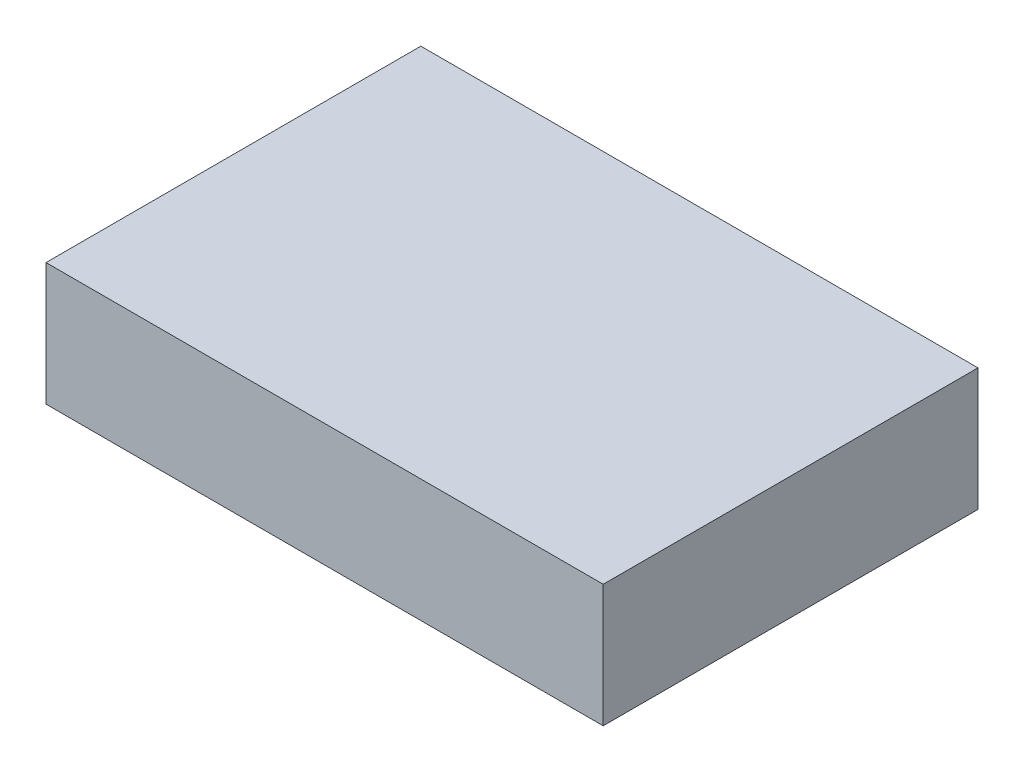
ISO-10303-21;
HEADER;
FILE_DESCRIPTION(('STEP AP214'),'2;1');
FILE_NAME('part.step','',(''),(''),'','','');
FILE_SCHEMA(('AUTOMOTIVE_DESIGN { 1 0 10303 214 1 1 1 1 }'));
ENDSEC;
DATA;
#1=APPLICATION_CONTEXT('core data for automotive mechanical design processes');
#2=APPLICATION_PROTOCOL_DEFINITION('international standard','automotive_design',2000,#1);
#3=PRODUCT_CONTEXT('',#1,'mechanical');
#4=PRODUCT('Part','Part','',(#3));
#5=PRODUCT_RELATED_PRODUCT_CATEGORY('part','',(#4));
#6=PRODUCT_DEFINITION_FORMATION('','',#4);
#7=PRODUCT_DEFINITION_CONTEXT('part definition',#1,'design');
#8=PRODUCT_DEFINITION('design','',#6,#7);
#9=PRODUCT_DEFINITION_SHAPE('','',#8);
#10=(LENGTH_UNIT() NAMED_UNIT(*) SI_UNIT(.MILLI.,.METRE.));
#11=(NAMED_UNIT(*) PLANE_ANGLE_UNIT() SI_UNIT($,.RADIAN.));
#12=(NAMED_UNIT(*) SI_UNIT($,.STERADIAN.) SOLID_ANGLE_UNIT());
#13=UNCERTAINTY_MEASURE_WITH_UNIT(LENGTH_MEASURE(1.E-05),#10,'distance_accuracy_value','');
#14=(GEOMETRIC_REPRESENTATION_CONTEXT(3) GLOBAL_UNCERTAINTY_ASSIGNED_CONTEXT((#13)) GLOBAL_UNIT_ASSIGNED_CONTEXT((#10,
#11,#12)) REPRESENTATION_CONTEXT('',''));
#15=CARTESIAN_POINT('',(0.,0.,0.));
#16=DIRECTION('',(0.,0.,1.));
#17=DIRECTION('',(1.,0.,0.));
#18=AXIS2_PLACEMENT_3D('',#15,#16,#17);
#19=CARTESIAN_POINT('',(-312.706003868978,28.1,-132.016665880732));
#20=DIRECTION('',(1.,0.,0.));
#21=DIRECTION('',(0.,0.,-1.));
#22=AXIS2_PLACEMENT_3D('',#19,#20,#21);
#23=PLANE('',#22);
#24=DIRECTION('',(0.,0.,1.));
#25=VECTOR('',#24,1.);
#26=CARTESIAN_POINT('',(-312.706003868978,0.,-132.016665880732));
#27=LINE('',#26,#25);
#28=CARTESIAN_POINT('',(-312.706003868978,0.,-132.016665880732));
#29=VERTEX_POINT('',#28);
#30=CARTESIAN_POINT('',(-312.706003868978,0.,-46.1166658807324));
#31=VERTEX_POINT('',#30);
#32=EDGE_CURVE('E106',#29,#31,#27,.T.);
#33=ORIENTED_EDGE('',*,*,#32,.T.);
#34=DIRECTION('',(0.,-1.,0.));
#35=VECTOR('',#34,1.);
#36=CARTESIAN_POINT('',(-312.706003868978,28.1,-46.1166658807324));
#37=LINE('',#36,#35);
#38=CARTESIAN_POINT('',(-312.706003868978,28.1,-46.1166658807324));
#39=VERTEX_POINT('',#38);
#40=EDGE_CURVE('E11',#39,#31,#37,.T.);
#41=ORIENTED_EDGE('',*,*,#40,.F.);
#42=DIRECTION('',(0.,0.,1.));
#43=VECTOR('',#42,1.);
#44=CARTESIAN_POINT('',(-312.706003868978,28.1,-132.016665880732));
#45=LINE('',#44,#43);
#46=CARTESIAN_POINT('',(-312.706003868978,28.1,-132.016665880732));
#47=VERTEX_POINT('',#46);
#48=EDGE_CURVE('E94',#47,#39,#45,.T.);
#49=ORIENTED_EDGE('',*,*,#48,.F.);
#50=DIRECTION('',(0.,-1.,0.));
#51=VECTOR('',#50,1.);
#52=CARTESIAN_POINT('',(-312.706003868978,28.1,-132.016665880732));
#53=LINE('',#52,#51);
#54=EDGE_CURVE('E102',#47,#29,#53,.T.);
#55=ORIENTED_EDGE('',*,*,#54,.T.);
#56=EDGE_LOOP('',(#33,#41,#49,#55));
#57=FACE_BOUND('',#56,.T.);
#58=ADVANCED_FACE('F43',(#57),#23,.F.);
#59=CARTESIAN_POINT('',(-312.706003868978,28.1,-46.1166658807324));
#60=DIRECTION('',(0.,0.,-1.));
#61=DIRECTION('',(-1.,0.,0.));
#62=AXIS2_PLACEMENT_3D('',#59,#60,#61);
#63=PLANE('',#62);
#64=DIRECTION('',(1.,0.,0.));
#65=VECTOR('',#64,1.);
#66=CARTESIAN_POINT('',(-312.706003868978,0.,-46.1166658807324));
#67=LINE('',#66,#65);
#68=CARTESIAN_POINT('',(-185.006003868978,0.,-46.1166658807324));
#69=VERTEX_POINT('',#68);
#70=EDGE_CURVE('E98',#31,#69,#67,.T.);
#71=ORIENTED_EDGE('',*,*,#70,.T.);
#72=DIRECTION('',(0.,-1.,0.));
#73=VECTOR('',#72,1.);
#74=CARTESIAN_POINT('',(-185.006003868978,28.1,-46.1166658807324));
#75=LINE('',#74,#73);
#76=CARTESIAN_POINT('',(-185.006003868978,28.1,-46.1166658807324));
#77=VERTEX_POINT('',#76);
#78=EDGE_CURVE('E51',#77,#69,#75,.T.);
#79=ORIENTED_EDGE('',*,*,#78,.F.);
#80=DIRECTION('',(1.,0.,0.));
#81=VECTOR('',#80,1.);
#82=CARTESIAN_POINT('',(-312.706003868978,28.1,-46.1166658807324));
#83=LINE('',#82,#81);
#84=EDGE_CURVE('E89',#39,#77,#83,.T.);
#85=ORIENTED_EDGE('',*,*,#84,.F.);
#86=ORIENTED_EDGE('',*,*,#40,.T.);
#87=EDGE_LOOP('',(#71,#79,#85,#86));
#88=FACE_BOUND('',#87,.T.);
#89=ADVANCED_FACE('F97',(#88),#63,.F.);
#90=CARTESIAN_POINT('',(-185.006003868978,28.1,-132.016665880732));
#91=DIRECTION('',(-1.,0.,0.));
#92=DIRECTION('',(0.,0.,1.));
#93=AXIS2_PLACEMENT_3D('',#90,#91,#92);
#94=PLANE('',#93);
#95=DIRECTION('',(0.,0.,-1.));
#96=VECTOR('',#95,1.);
#97=CARTESIAN_POINT('',(-185.006003868978,0.,-132.016665880732));
#98=LINE('',#97,#96);
#99=CARTESIAN_POINT('',(-185.006003868978,0.,-132.016665880732));
#100=VERTEX_POINT('',#99);
#101=EDGE_CURVE('E76',#69,#100,#98,.T.);
#102=ORIENTED_EDGE('',*,*,#101,.T.);
#103=DIRECTION('',(0.,-1.,0.));
#104=VECTOR('',#103,1.);
#105=CARTESIAN_POINT('',(-185.006003868978,28.1,-132.016665880732));
#106=LINE('',#105,#104);
#107=CARTESIAN_POINT('',(-185.006003868978,28.1,-132.016665880732));
#108=VERTEX_POINT('',#107);
#109=EDGE_CURVE('E99',#108,#100,#106,.T.);
#110=ORIENTED_EDGE('',*,*,#109,.F.);
#111=DIRECTION('',(0.,0.,-1.));
#112=VECTOR('',#111,1.);
#113=CARTESIAN_POINT('',(-185.006003868978,28.1,-132.016665880732));
#114=LINE('',#113,#112);
#115=EDGE_CURVE('E92',#77,#108,#114,.T.);
#116=ORIENTED_EDGE('',*,*,#115,.F.);
#117=ORIENTED_EDGE('',*,*,#78,.T.);
#118=EDGE_LOOP('',(#102,#110,#116,#117));
#119=FACE_BOUND('',#118,.T.);
#120=ADVANCED_FACE('F100',(#119),#94,.F.);
#121=CARTESIAN_POINT('',(-312.706003868978,28.1,-132.016665880732));
#122=DIRECTION('',(0.,0.,1.));
#123=DIRECTION('',(1.,0.,0.));
#124=AXIS2_PLACEMENT_3D('',#121,#122,#123);
#125=PLANE('',#124);
#126=DIRECTION('',(-1.,0.,0.));
#127=VECTOR('',#126,1.);
#128=CARTESIAN_POINT('',(-312.706003868978,0.,-132.016665880732));
#129=LINE('',#128,#127);
#130=EDGE_CURVE('E82',#100,#29,#129,.T.);
#131=ORIENTED_EDGE('',*,*,#130,.T.);
#132=ORIENTED_EDGE('',*,*,#54,.F.);
#133=DIRECTION('',(-1.,0.,0.));
#134=VECTOR('',#133,1.);
#135=CARTESIAN_POINT('',(-312.706003868978,28.1,-132.016665880732));
#136=LINE('',#135,#134);
#137=EDGE_CURVE('E59',#108,#47,#136,.T.);
#138=ORIENTED_EDGE('',*,*,#137,.F.);
#139=ORIENTED_EDGE('',*,*,#109,.T.);
#140=EDGE_LOOP('',(#131,#132,#138,#139));
#141=FACE_BOUND('',#140,.T.);
#142=ADVANCED_FACE('F113',(#141),#125,.F.);
#143=CARTESIAN_POINT('',(0.,28.1,0.));
#144=DIRECTION('',(0.,1.,0.));
#145=DIRECTION('',(0.,0.,1.));
#146=AXIS2_PLACEMENT_3D('',#143,#144,#145);
#147=PLANE('',#146);
#148=ORIENTED_EDGE('',*,*,#48,.T.);
#149=ORIENTED_EDGE('',*,*,#84,.T.);
#150=ORIENTED_EDGE('',*,*,#115,.T.);
#151=ORIENTED_EDGE('',*,*,#137,.T.);
#152=EDGE_LOOP('',(#148,#149,#150,#151));
#153=FACE_BOUND('',#152,.T.);
#154=ADVANCED_FACE('F90',(#153),#147,.T.);
#155=CARTESIAN_POINT('',(0.,0.,0.));
#156=DIRECTION('',(0.,1.,0.));
#157=DIRECTION('',(0.,0.,1.));
#158=AXIS2_PLACEMENT_3D('',#155,#156,#157);
#159=PLANE('',#158);
#160=ORIENTED_EDGE('',*,*,#32,.F.);
#161=ORIENTED_EDGE('',*,*,#130,.F.);
#162=ORIENTED_EDGE('',*,*,#101,.F.);
#163=ORIENTED_EDGE('',*,*,#70,.F.);
#164=EDGE_LOOP('',(#160,#161,#162,#163));
#165=FACE_BOUND('',#164,.T.);
#166=ADVANCED_FACE('F116',(#165),#159,.F.);
#167=CLOSED_SHELL('',(#58,#89,#120,#142,#154,#166));
#168=MANIFOLD_SOLID_BREP('B2',#167);
#169=ADVANCED_BREP_SHAPE_REPRESENTATION('',(#18,#168),#14);
#170=SHAPE_DEFINITION_REPRESENTATION(#9,#169);
ENDSEC;
END-ISO-10303-21;
